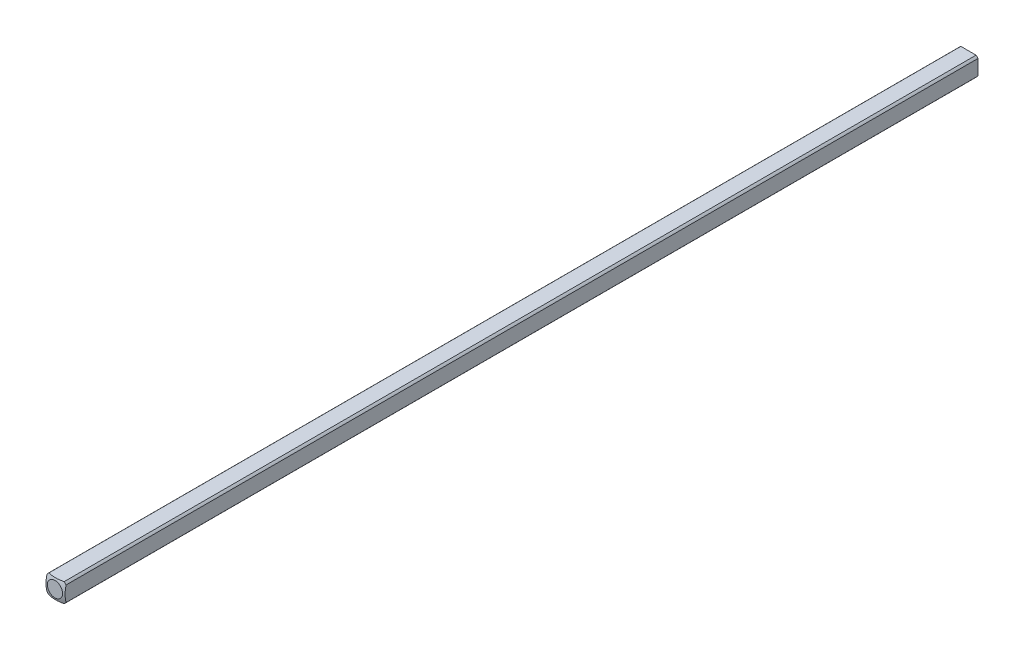
ISO-10303-21;
HEADER;
FILE_DESCRIPTION(('STEP AP214'),'2;1');
FILE_NAME('part.step','',(''),(''),'','','');
FILE_SCHEMA(('AUTOMOTIVE_DESIGN { 1 0 10303 214 1 1 1 1 }'));
ENDSEC;
DATA;
#1=APPLICATION_CONTEXT('core data for automotive mechanical design processes');
#2=APPLICATION_PROTOCOL_DEFINITION('international standard','automotive_design',2000,#1);
#3=PRODUCT_CONTEXT('',#1,'mechanical');
#4=PRODUCT('Part','Part','',(#3));
#5=PRODUCT_RELATED_PRODUCT_CATEGORY('part','',(#4));
#6=PRODUCT_DEFINITION_FORMATION('','',#4);
#7=PRODUCT_DEFINITION_CONTEXT('part definition',#1,'design');
#8=PRODUCT_DEFINITION('design','',#6,#7);
#9=PRODUCT_DEFINITION_SHAPE('','',#8);
#10=(LENGTH_UNIT() NAMED_UNIT(*) SI_UNIT(.MILLI.,.METRE.));
#11=(NAMED_UNIT(*) PLANE_ANGLE_UNIT() SI_UNIT($,.RADIAN.));
#12=(NAMED_UNIT(*) SI_UNIT($,.STERADIAN.) SOLID_ANGLE_UNIT());
#13=UNCERTAINTY_MEASURE_WITH_UNIT(LENGTH_MEASURE(1.E-05),#10,'distance_accuracy_value','');
#14=(GEOMETRIC_REPRESENTATION_CONTEXT(3) GLOBAL_UNCERTAINTY_ASSIGNED_CONTEXT((#13)) GLOBAL_UNIT_ASSIGNED_CONTEXT((#10,
#11,#12)) REPRESENTATION_CONTEXT('',''));
#15=CARTESIAN_POINT('',(0.,0.,0.));
#16=DIRECTION('',(0.,0.,1.));
#17=DIRECTION('',(1.,0.,0.));
#18=AXIS2_PLACEMENT_3D('',#15,#16,#17);
#19=CARTESIAN_POINT('',(-1.5875,-1.5875,152.4));
#20=DIRECTION('',(1.,0.,0.));
#21=DIRECTION('',(0.,0.,-1.));
#22=AXIS2_PLACEMENT_3D('',#19,#20,#21);
#23=PLANE('',#22);
#24=DIRECTION('',(0.,0.,-1.));
#25=VECTOR('',#24,1.);
#26=CARTESIAN_POINT('',(-1.5875,1.26841150657032,152.4));
#27=LINE('',#26,#25);
#28=CARTESIAN_POINT('',(-1.5875,1.26841150657032,152.663225357687));
#29=VERTEX_POINT('',#28);
#30=CARTESIAN_POINT('',(-1.5875,1.26841150657032,304.536774642313));
#31=VERTEX_POINT('',#30);
#32=EDGE_CURVE('E93',#29,#31,#27,.F.);
#33=ORIENTED_EDGE('',*,*,#32,.F.);
#34=DIRECTION('',(0.,-1.,0.));
#35=VECTOR('',#34,1.);
#36=CARTESIAN_POINT('',(-1.5875,-1.58750000000003,152.663225357687));
#37=LINE('',#36,#35);
#38=CARTESIAN_POINT('',(-1.5875,-1.26841150657032,152.663225357687));
#39=VERTEX_POINT('',#38);
#40=EDGE_CURVE('E36',#29,#39,#37,.T.);
#41=ORIENTED_EDGE('',*,*,#40,.T.);
#42=DIRECTION('',(0.,0.,-1.));
#43=VECTOR('',#42,1.);
#44=CARTESIAN_POINT('',(-1.5875,-1.26841150657032,152.4));
#45=LINE('',#44,#43);
#46=CARTESIAN_POINT('',(-1.5875,-1.26841150657032,304.536774642313));
#47=VERTEX_POINT('',#46);
#48=EDGE_CURVE('E106',#47,#39,#45,.T.);
#49=ORIENTED_EDGE('',*,*,#48,.F.);
#50=CARTESIAN_POINT('',(-1.5875,0.,299.880877736238));
#51=DIRECTION('',(-1.,0.,0.));
#52=DIRECTION('',(0.,0.,1.));
#53=AXIS2_PLACEMENT_3D('',#50,#51,#52);
#54=CIRCLE('',#53,4.82558221875869);
#55=EDGE_CURVE('E129',#47,#31,#54,.T.);
#56=ORIENTED_EDGE('',*,*,#55,.T.);
#57=EDGE_LOOP('',(#33,#41,#49,#56));
#58=FACE_BOUND('',#57,.T.);
#59=ADVANCED_FACE('F33',(#58),#23,.F.);
#60=CARTESIAN_POINT('',(-1.5875,-1.5875,152.4));
#61=DIRECTION('',(0.,1.,0.));
#62=DIRECTION('',(0.,0.,1.));
#63=AXIS2_PLACEMENT_3D('',#60,#61,#62);
#64=PLANE('',#63);
#65=DIRECTION('',(0.,0.,-1.));
#66=VECTOR('',#65,1.);
#67=CARTESIAN_POINT('',(-1.26841150657032,-1.5875,152.4));
#68=LINE('',#67,#66);
#69=CARTESIAN_POINT('',(-1.26841150657029,-1.58750000000003,152.663225357687));
#70=VERTEX_POINT('',#69);
#71=CARTESIAN_POINT('',(-1.26841150657032,-1.5875,304.536774642313));
#72=VERTEX_POINT('',#71);
#73=EDGE_CURVE('E103',#70,#72,#68,.F.);
#74=ORIENTED_EDGE('',*,*,#73,.F.);
#75=DIRECTION('',(1.,0.,0.));
#76=VECTOR('',#75,1.);
#77=CARTESIAN_POINT('',(-1.5875,-1.58750000000003,152.663225357687));
#78=LINE('',#77,#76);
#79=CARTESIAN_POINT('',(1.26841150657029,-1.58750000000003,152.663225357687));
#80=VERTEX_POINT('',#79);
#81=EDGE_CURVE('E50',#70,#80,#78,.T.);
#82=ORIENTED_EDGE('',*,*,#81,.T.);
#83=DIRECTION('',(0.,0.,-1.));
#84=VECTOR('',#83,1.);
#85=CARTESIAN_POINT('',(1.26841150657032,-1.5875,152.4));
#86=LINE('',#85,#84);
#87=CARTESIAN_POINT('',(1.26841150657032,-1.5875,304.536774642313));
#88=VERTEX_POINT('',#87);
#89=EDGE_CURVE('E99',#88,#80,#86,.T.);
#90=ORIENTED_EDGE('',*,*,#89,.F.);
#91=CARTESIAN_POINT('',(0.,-1.5875,299.880877736238));
#92=DIRECTION('',(0.,-1.,0.));
#93=DIRECTION('',(0.,0.,-1.));
#94=AXIS2_PLACEMENT_3D('',#91,#92,#93);
#95=CIRCLE('',#94,4.82558221875869);
#96=EDGE_CURVE('E119',#88,#72,#95,.T.);
#97=ORIENTED_EDGE('',*,*,#96,.T.);
#98=EDGE_LOOP('',(#74,#82,#90,#97));
#99=FACE_BOUND('',#98,.T.);
#100=ADVANCED_FACE('F141',(#99),#64,.F.);
#101=CARTESIAN_POINT('',(1.5875,-1.5875,152.4));
#102=DIRECTION('',(-1.,0.,0.));
#103=DIRECTION('',(0.,0.,1.));
#104=AXIS2_PLACEMENT_3D('',#101,#102,#103);
#105=PLANE('',#104);
#106=DIRECTION('',(0.,0.,-1.));
#107=VECTOR('',#106,1.);
#108=CARTESIAN_POINT('',(1.5875,-1.26841150657032,152.4));
#109=LINE('',#108,#107);
#110=CARTESIAN_POINT('',(1.5875,-1.26841150657032,152.663225357687));
#111=VERTEX_POINT('',#110);
#112=CARTESIAN_POINT('',(1.5875,-1.26841150657032,304.536774642313));
#113=VERTEX_POINT('',#112);
#114=EDGE_CURVE('E88',#111,#113,#109,.F.);
#115=ORIENTED_EDGE('',*,*,#114,.F.);
#116=DIRECTION('',(0.,-1.,0.));
#117=VECTOR('',#116,1.);
#118=CARTESIAN_POINT('',(1.5875,-1.58750000000003,152.663225357687));
#119=LINE('',#118,#117);
#120=CARTESIAN_POINT('',(1.5875,1.26841150657032,152.663225357687));
#121=VERTEX_POINT('',#120);
#122=EDGE_CURVE('E42',#121,#111,#119,.T.);
#123=ORIENTED_EDGE('',*,*,#122,.F.);
#124=DIRECTION('',(0.,0.,-1.));
#125=VECTOR('',#124,1.);
#126=CARTESIAN_POINT('',(1.5875,1.26841150657032,152.4));
#127=LINE('',#126,#125);
#128=CARTESIAN_POINT('',(1.5875,1.26841150657032,304.536774642313));
#129=VERTEX_POINT('',#128);
#130=EDGE_CURVE('E85',#129,#121,#127,.T.);
#131=ORIENTED_EDGE('',*,*,#130,.F.);
#132=CARTESIAN_POINT('',(1.5875,0.,299.880877736238));
#133=DIRECTION('',(1.,0.,0.));
#134=DIRECTION('',(0.,0.,-1.));
#135=AXIS2_PLACEMENT_3D('',#132,#133,#134);
#136=CIRCLE('',#135,4.82558221875869);
#137=EDGE_CURVE('E122',#129,#113,#136,.T.);
#138=ORIENTED_EDGE('',*,*,#137,.T.);
#139=EDGE_LOOP('',(#115,#123,#131,#138));
#140=FACE_BOUND('',#139,.T.);
#141=ADVANCED_FACE('F82',(#140),#105,.F.);
#142=CARTESIAN_POINT('',(-1.5875,1.5875,152.4));
#143=DIRECTION('',(0.,-1.,0.));
#144=DIRECTION('',(0.,0.,-1.));
#145=AXIS2_PLACEMENT_3D('',#142,#143,#144);
#146=PLANE('',#145);
#147=DIRECTION('',(0.,0.,-1.));
#148=VECTOR('',#147,1.);
#149=CARTESIAN_POINT('',(1.26841150657032,1.5875,152.4));
#150=LINE('',#149,#148);
#151=CARTESIAN_POINT('',(1.26841150657036,1.58749999999997,152.663225357687));
#152=VERTEX_POINT('',#151);
#153=CARTESIAN_POINT('',(1.26841150657032,1.5875,304.536774642313));
#154=VERTEX_POINT('',#153);
#155=EDGE_CURVE('E94',#152,#154,#150,.F.);
#156=ORIENTED_EDGE('',*,*,#155,.F.);
#157=DIRECTION('',(1.,0.,0.));
#158=VECTOR('',#157,1.);
#159=CARTESIAN_POINT('',(-1.5875,1.58749999999997,152.663225357687));
#160=LINE('',#159,#158);
#161=CARTESIAN_POINT('',(-1.26841150657036,1.58749999999997,152.663225357687));
#162=VERTEX_POINT('',#161);
#163=EDGE_CURVE('E73',#162,#152,#160,.T.);
#164=ORIENTED_EDGE('',*,*,#163,.F.);
#165=DIRECTION('',(0.,0.,-1.));
#166=VECTOR('',#165,1.);
#167=CARTESIAN_POINT('',(-1.26841150657032,1.5875,152.4));
#168=LINE('',#167,#166);
#169=CARTESIAN_POINT('',(-1.26841150657032,1.5875,304.536774642313));
#170=VERTEX_POINT('',#169);
#171=EDGE_CURVE('E97',#170,#162,#168,.T.);
#172=ORIENTED_EDGE('',*,*,#171,.F.);
#173=CARTESIAN_POINT('',(0.,1.5875,299.880877736238));
#174=DIRECTION('',(0.,1.,0.));
#175=DIRECTION('',(0.,0.,1.));
#176=AXIS2_PLACEMENT_3D('',#173,#174,#175);
#177=CIRCLE('',#176,4.82558221875869);
#178=EDGE_CURVE('E124',#170,#154,#177,.T.);
#179=ORIENTED_EDGE('',*,*,#178,.T.);
#180=EDGE_LOOP('',(#156,#164,#172,#179));
#181=FACE_BOUND('',#180,.T.);
#182=ADVANCED_FACE('F158',(#181),#146,.F.);
#183=CARTESIAN_POINT('',(0.,0.,152.4));
#184=DIRECTION('',(0.,0.,-1.));
#185=DIRECTION('',(-1.,0.,0.));
#186=AXIS2_PLACEMENT_3D('',#183,#184,#185);
#187=CYLINDRICAL_SURFACE('',#186,2.032);
#188=CARTESIAN_POINT('',(0.,0.,152.663225357687));
#189=DIRECTION('',(0.,0.,1.));
#190=DIRECTION('',(1.,0.,0.));
#191=AXIS2_PLACEMENT_3D('',#188,#189,#190);
#192=CIRCLE('',#191,2.032);
#193=EDGE_CURVE('E127',#70,#39,#192,.F.);
#194=ORIENTED_EDGE('',*,*,#193,.F.);
#195=ORIENTED_EDGE('',*,*,#73,.T.);
#196=CARTESIAN_POINT('',(0.,0.,304.536774642313));
#197=DIRECTION('',(0.,0.,1.));
#198=DIRECTION('',(1.,0.,0.));
#199=AXIS2_PLACEMENT_3D('',#196,#197,#198);
#200=CIRCLE('',#199,2.032);
#201=EDGE_CURVE('E113',#47,#72,#200,.T.);
#202=ORIENTED_EDGE('',*,*,#201,.F.);
#203=ORIENTED_EDGE('',*,*,#48,.T.);
#204=EDGE_LOOP('',(#194,#195,#202,#203));
#205=FACE_BOUND('',#204,.T.);
#206=ADVANCED_FACE('F181',(#205),#187,.T.);
#207=CARTESIAN_POINT('',(0.,0.,152.663225357687));
#208=DIRECTION('',(0.,0.,1.));
#209=DIRECTION('',(1.,0.,0.));
#210=AXIS2_PLACEMENT_3D('',#207,#208,#209);
#211=CIRCLE('',#210,2.032);
#212=EDGE_CURVE('E12',#111,#80,#211,.F.);
#213=ORIENTED_EDGE('',*,*,#212,.F.);
#214=ORIENTED_EDGE('',*,*,#114,.T.);
#215=CARTESIAN_POINT('',(0.,0.,304.536774642313));
#216=DIRECTION('',(0.,0.,1.));
#217=DIRECTION('',(1.,0.,0.));
#218=AXIS2_PLACEMENT_3D('',#215,#216,#217);
#219=CIRCLE('',#218,2.032);
#220=EDGE_CURVE('E116',#88,#113,#219,.T.);
#221=ORIENTED_EDGE('',*,*,#220,.F.);
#222=ORIENTED_EDGE('',*,*,#89,.T.);
#223=EDGE_LOOP('',(#213,#214,#221,#222));
#224=FACE_BOUND('',#223,.T.);
#225=ADVANCED_FACE('F146',(#224),#187,.T.);
#226=CARTESIAN_POINT('',(0.,0.,152.663225357687));
#227=DIRECTION('',(0.,0.,1.));
#228=DIRECTION('',(1.,0.,0.));
#229=AXIS2_PLACEMENT_3D('',#226,#227,#228);
#230=CIRCLE('',#229,2.032);
#231=EDGE_CURVE('E70',#152,#121,#230,.F.);
#232=ORIENTED_EDGE('',*,*,#231,.F.);
#233=ORIENTED_EDGE('',*,*,#155,.T.);
#234=CARTESIAN_POINT('',(0.,0.,304.536774642313));
#235=DIRECTION('',(0.,0.,1.));
#236=DIRECTION('',(1.,0.,0.));
#237=AXIS2_PLACEMENT_3D('',#234,#235,#236);
#238=CIRCLE('',#237,2.032);
#239=EDGE_CURVE('E91',#129,#154,#238,.T.);
#240=ORIENTED_EDGE('',*,*,#239,.F.);
#241=ORIENTED_EDGE('',*,*,#130,.T.);
#242=EDGE_LOOP('',(#232,#233,#240,#241));
#243=FACE_BOUND('',#242,.T.);
#244=ADVANCED_FACE('F89',(#243),#187,.T.);
#245=CARTESIAN_POINT('',(0.,0.,152.663225357687));
#246=DIRECTION('',(0.,0.,1.));
#247=DIRECTION('',(1.,0.,0.));
#248=AXIS2_PLACEMENT_3D('',#245,#246,#247);
#249=CIRCLE('',#248,2.032);
#250=EDGE_CURVE('E134',#29,#162,#249,.F.);
#251=ORIENTED_EDGE('',*,*,#250,.F.);
#252=ORIENTED_EDGE('',*,*,#32,.T.);
#253=CARTESIAN_POINT('',(0.,0.,304.536774642313));
#254=DIRECTION('',(0.,0.,1.));
#255=DIRECTION('',(1.,0.,0.));
#256=AXIS2_PLACEMENT_3D('',#253,#254,#255);
#257=CIRCLE('',#256,2.032);
#258=EDGE_CURVE('E110',#170,#31,#257,.T.);
#259=ORIENTED_EDGE('',*,*,#258,.F.);
#260=ORIENTED_EDGE('',*,*,#171,.T.);
#261=EDGE_LOOP('',(#251,#252,#259,#260));
#262=FACE_BOUND('',#261,.T.);
#263=ADVANCED_FACE('F161',(#262),#187,.T.);
#264=CARTESIAN_POINT('',(0.,0.,299.880877736238));
#265=DIRECTION('',(0.,0.,-1.));
#266=DIRECTION('',(-1.,0.,0.));
#267=AXIS2_PLACEMENT_3D('',#264,#265,#266);
#268=SPHERICAL_SURFACE('',#267,5.08);
#269=CARTESIAN_POINT('',(0.,0.,304.8));
#270=DIRECTION('',(0.,0.,-1.));
#271=DIRECTION('',(-1.,0.,0.));
#272=AXIS2_PLACEMENT_3D('',#269,#270,#271);
#273=CIRCLE('',#272,1.26832020963187);
#274=CARTESIAN_POINT('',(-1.26832020963187,0.,304.8));
#275=VERTEX_POINT('',#274);
#276=EDGE_CURVE('E108',#275,#275,#273,.T.);
#277=ORIENTED_EDGE('',*,*,#276,.T.);
#278=EDGE_LOOP('',(#277));
#279=FACE_BOUND('',#278,.T.);
#280=ORIENTED_EDGE('',*,*,#96,.F.);
#281=ORIENTED_EDGE('',*,*,#220,.T.);
#282=ORIENTED_EDGE('',*,*,#137,.F.);
#283=ORIENTED_EDGE('',*,*,#239,.T.);
#284=ORIENTED_EDGE('',*,*,#178,.F.);
#285=ORIENTED_EDGE('',*,*,#258,.T.);
#286=ORIENTED_EDGE('',*,*,#55,.F.);
#287=ORIENTED_EDGE('',*,*,#201,.T.);
#288=EDGE_LOOP('',(#280,#281,#282,#283,#284,#285,#286,#287));
#289=FACE_BOUND('',#288,.T.);
#290=ADVANCED_FACE('F166',(#279,#289),#268,.T.);
#291=CARTESIAN_POINT('',(0.,0.,304.8));
#292=DIRECTION('',(0.,0.,1.));
#293=DIRECTION('',(-1.,0.,0.));
#294=AXIS2_PLACEMENT_3D('',#291,#292,#293);
#295=PLANE('',#294);
#296=ORIENTED_EDGE('',*,*,#276,.F.);
#297=EDGE_LOOP('',(#296));
#298=FACE_BOUND('',#297,.T.);
#299=ADVANCED_FACE('F196',(#298),#295,.T.);
#300=CARTESIAN_POINT('',(-1.5875,-1.58750000000003,152.663225357687));
#301=DIRECTION('',(0.,0.,1.));
#302=DIRECTION('',(1.,0.,0.));
#303=AXIS2_PLACEMENT_3D('',#300,#301,#302);
#304=PLANE('',#303);
#305=ORIENTED_EDGE('',*,*,#193,.T.);
#306=ORIENTED_EDGE('',*,*,#40,.F.);
#307=ORIENTED_EDGE('',*,*,#250,.T.);
#308=ORIENTED_EDGE('',*,*,#163,.T.);
#309=ORIENTED_EDGE('',*,*,#231,.T.);
#310=ORIENTED_EDGE('',*,*,#122,.T.);
#311=ORIENTED_EDGE('',*,*,#212,.T.);
#312=ORIENTED_EDGE('',*,*,#81,.F.);
#313=EDGE_LOOP('',(#305,#306,#307,#308,#309,#310,#311,#312));
#314=FACE_BOUND('',#313,.T.);
#315=ADVANCED_FACE('F71',(#314),#304,.F.);
#316=CLOSED_SHELL('',(#59,#100,#141,#182,#206,#225,#244,#263,#290,#299,#315));
#317=MANIFOLD_SOLID_BREP('B2',#316);
#318=ADVANCED_BREP_SHAPE_REPRESENTATION('',(#18,#317),#14);
#319=SHAPE_DEFINITION_REPRESENTATION(#9,#318);
ENDSEC;
END-ISO-10303-21;
